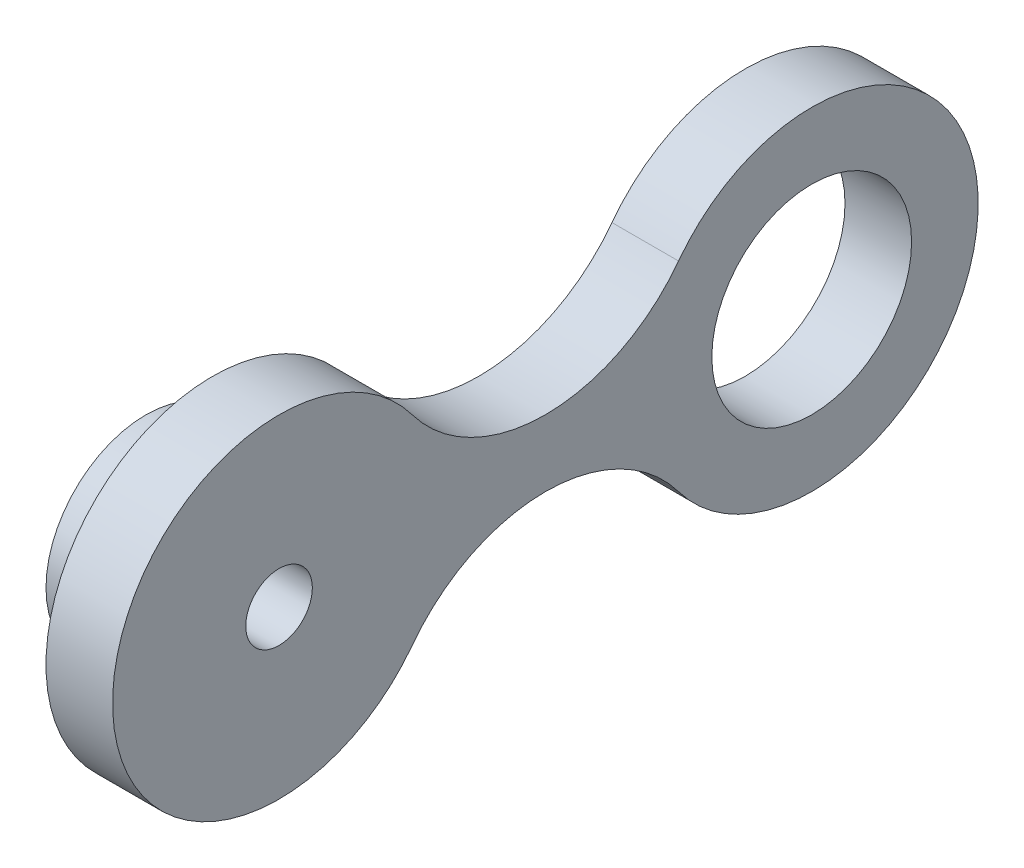
ISO-10303-21;
HEADER;
FILE_DESCRIPTION(('STEP AP214'),'2;1');
FILE_NAME('part.step','',(''),(''),'','','');
FILE_SCHEMA(('AUTOMOTIVE_DESIGN { 1 0 10303 214 1 1 1 1 }'));
ENDSEC;
DATA;
#1=APPLICATION_CONTEXT('core data for automotive mechanical design processes');
#2=APPLICATION_PROTOCOL_DEFINITION('international standard','automotive_design',2000,#1);
#3=PRODUCT_CONTEXT('',#1,'mechanical');
#4=PRODUCT('Part','Part','',(#3));
#5=PRODUCT_RELATED_PRODUCT_CATEGORY('part','',(#4));
#6=PRODUCT_DEFINITION_FORMATION('','',#4);
#7=PRODUCT_DEFINITION_CONTEXT('part definition',#1,'design');
#8=PRODUCT_DEFINITION('design','',#6,#7);
#9=PRODUCT_DEFINITION_SHAPE('','',#8);
#10=(LENGTH_UNIT() NAMED_UNIT(*) SI_UNIT(.MILLI.,.METRE.));
#11=(NAMED_UNIT(*) PLANE_ANGLE_UNIT() SI_UNIT($,.RADIAN.));
#12=(NAMED_UNIT(*) SI_UNIT($,.STERADIAN.) SOLID_ANGLE_UNIT());
#13=UNCERTAINTY_MEASURE_WITH_UNIT(LENGTH_MEASURE(1.E-05),#10,'distance_accuracy_value','');
#14=(GEOMETRIC_REPRESENTATION_CONTEXT(3) GLOBAL_UNCERTAINTY_ASSIGNED_CONTEXT((#13)) GLOBAL_UNIT_ASSIGNED_CONTEXT((#10,
#11,#12)) REPRESENTATION_CONTEXT('',''));
#15=CARTESIAN_POINT('',(0.,0.,0.));
#16=DIRECTION('',(0.,0.,1.));
#17=DIRECTION('',(1.,0.,0.));
#18=AXIS2_PLACEMENT_3D('',#15,#16,#17);
#19=CARTESIAN_POINT('',(10.,-30.,-40.));
#20=DIRECTION('',(-1.,0.,0.));
#21=DIRECTION('',(0.,0.,1.));
#22=AXIS2_PLACEMENT_3D('',#19,#20,#21);
#23=CYLINDRICAL_SURFACE('',#22,25.);
#24=CARTESIAN_POINT('',(0.,-30.,-40.));
#25=DIRECTION('',(1.,0.,0.));
#26=DIRECTION('',(0.,0.,-1.));
#27=AXIS2_PLACEMENT_3D('',#24,#25,#26);
#28=CIRCLE('',#27,25.);
#29=CARTESIAN_POINT('',(0.,-15.,-20.));
#30=VERTEX_POINT('',#29);
#31=CARTESIAN_POINT('',(0.,-15.,-60.));
#32=VERTEX_POINT('',#31);
#33=EDGE_CURVE('E109',#30,#32,#28,.F.);
#34=ORIENTED_EDGE('',*,*,#33,.T.);
#35=DIRECTION('',(-1.,0.,0.));
#36=VECTOR('',#35,1.);
#37=CARTESIAN_POINT('',(10.,-15.,-60.));
#38=LINE('',#37,#36);
#39=CARTESIAN_POINT('',(10.,-15.,-60.));
#40=VERTEX_POINT('',#39);
#41=EDGE_CURVE('E48',#40,#32,#38,.T.);
#42=ORIENTED_EDGE('',*,*,#41,.F.);
#43=CARTESIAN_POINT('',(10.,-30.,-40.));
#44=DIRECTION('',(1.,0.,0.));
#45=DIRECTION('',(0.,0.,-1.));
#46=AXIS2_PLACEMENT_3D('',#43,#44,#45);
#47=CIRCLE('',#46,25.);
#48=CARTESIAN_POINT('',(10.,-15.,-20.));
#49=VERTEX_POINT('',#48);
#50=EDGE_CURVE('E89',#49,#40,#47,.F.);
#51=ORIENTED_EDGE('',*,*,#50,.F.);
#52=DIRECTION('',(-1.,0.,0.));
#53=VECTOR('',#52,1.);
#54=CARTESIAN_POINT('',(10.,-15.,-20.));
#55=LINE('',#54,#53);
#56=EDGE_CURVE('E108',#49,#30,#55,.T.);
#57=ORIENTED_EDGE('',*,*,#56,.T.);
#58=EDGE_LOOP('',(#34,#42,#51,#57));
#59=FACE_BOUND('',#58,.T.);
#60=ADVANCED_FACE('F40',(#59),#23,.F.);
#61=CARTESIAN_POINT('',(10.,0.,-80.));
#62=DIRECTION('',(-1.,0.,0.));
#63=DIRECTION('',(0.,0.,1.));
#64=AXIS2_PLACEMENT_3D('',#61,#62,#63);
#65=CYLINDRICAL_SURFACE('',#64,25.);
#66=CARTESIAN_POINT('',(0.,0.,-80.));
#67=DIRECTION('',(1.,0.,0.));
#68=DIRECTION('',(0.,0.,-1.));
#69=AXIS2_PLACEMENT_3D('',#66,#67,#68);
#70=CIRCLE('',#69,25.);
#71=CARTESIAN_POINT('',(0.,15.,-60.));
#72=VERTEX_POINT('',#71);
#73=EDGE_CURVE('E95',#32,#72,#70,.T.);
#74=ORIENTED_EDGE('',*,*,#73,.T.);
#75=DIRECTION('',(-1.,0.,0.));
#76=VECTOR('',#75,1.);
#77=CARTESIAN_POINT('',(10.,15.,-60.));
#78=LINE('',#77,#76);
#79=CARTESIAN_POINT('',(10.,15.,-60.));
#80=VERTEX_POINT('',#79);
#81=EDGE_CURVE('E93',#80,#72,#78,.T.);
#82=ORIENTED_EDGE('',*,*,#81,.F.);
#83=CARTESIAN_POINT('',(10.,0.,-80.));
#84=DIRECTION('',(1.,0.,0.));
#85=DIRECTION('',(0.,0.,-1.));
#86=AXIS2_PLACEMENT_3D('',#83,#84,#85);
#87=CIRCLE('',#86,25.);
#88=EDGE_CURVE('E83',#40,#80,#87,.T.);
#89=ORIENTED_EDGE('',*,*,#88,.F.);
#90=ORIENTED_EDGE('',*,*,#41,.T.);
#91=EDGE_LOOP('',(#74,#82,#89,#90));
#92=FACE_BOUND('',#91,.T.);
#93=ADVANCED_FACE('F94',(#92),#65,.T.);
#94=CARTESIAN_POINT('',(10.,30.,-40.));
#95=DIRECTION('',(-1.,0.,0.));
#96=DIRECTION('',(0.,0.,1.));
#97=AXIS2_PLACEMENT_3D('',#94,#95,#96);
#98=CYLINDRICAL_SURFACE('',#97,25.);
#99=CARTESIAN_POINT('',(0.,30.,-40.));
#100=DIRECTION('',(1.,0.,0.));
#101=DIRECTION('',(0.,0.,-1.));
#102=AXIS2_PLACEMENT_3D('',#99,#100,#101);
#103=CIRCLE('',#102,25.);
#104=CARTESIAN_POINT('',(0.,15.,-20.));
#105=VERTEX_POINT('',#104);
#106=EDGE_CURVE('E114',#105,#72,#103,.T.);
#107=ORIENTED_EDGE('',*,*,#106,.F.);
#108=DIRECTION('',(-1.,0.,0.));
#109=VECTOR('',#108,1.);
#110=CARTESIAN_POINT('',(10.,15.,-20.));
#111=LINE('',#110,#109);
#112=CARTESIAN_POINT('',(10.,15.,-20.));
#113=VERTEX_POINT('',#112);
#114=EDGE_CURVE('E72',#113,#105,#111,.T.);
#115=ORIENTED_EDGE('',*,*,#114,.F.);
#116=CARTESIAN_POINT('',(10.,30.,-40.));
#117=DIRECTION('',(1.,0.,0.));
#118=DIRECTION('',(0.,0.,-1.));
#119=AXIS2_PLACEMENT_3D('',#116,#117,#118);
#120=CIRCLE('',#119,25.);
#121=EDGE_CURVE('E87',#113,#80,#120,.T.);
#122=ORIENTED_EDGE('',*,*,#121,.T.);
#123=ORIENTED_EDGE('',*,*,#81,.T.);
#124=EDGE_LOOP('',(#107,#115,#122,#123));
#125=FACE_BOUND('',#124,.T.);
#126=ADVANCED_FACE('F100',(#125),#98,.F.);
#127=CARTESIAN_POINT('',(10.,0.,0.));
#128=DIRECTION('',(-1.,0.,0.));
#129=DIRECTION('',(0.,0.,1.));
#130=AXIS2_PLACEMENT_3D('',#127,#128,#129);
#131=CYLINDRICAL_SURFACE('',#130,25.);
#132=CARTESIAN_POINT('',(0.,0.,0.));
#133=DIRECTION('',(1.,0.,0.));
#134=DIRECTION('',(0.,0.,-1.));
#135=AXIS2_PLACEMENT_3D('',#132,#133,#134);
#136=CIRCLE('',#135,25.);
#137=EDGE_CURVE('E75',#105,#30,#136,.T.);
#138=ORIENTED_EDGE('',*,*,#137,.T.);
#139=ORIENTED_EDGE('',*,*,#56,.F.);
#140=CARTESIAN_POINT('',(10.,0.,0.));
#141=DIRECTION('',(1.,0.,0.));
#142=DIRECTION('',(0.,0.,-1.));
#143=AXIS2_PLACEMENT_3D('',#140,#141,#142);
#144=CIRCLE('',#143,25.);
#145=EDGE_CURVE('E56',#113,#49,#144,.T.);
#146=ORIENTED_EDGE('',*,*,#145,.F.);
#147=ORIENTED_EDGE('',*,*,#114,.T.);
#148=EDGE_LOOP('',(#138,#139,#146,#147));
#149=FACE_BOUND('',#148,.T.);
#150=ADVANCED_FACE('F134',(#149),#131,.T.);
#151=CARTESIAN_POINT('',(10.,0.,-80.));
#152=DIRECTION('',(-1.,0.,0.));
#153=DIRECTION('',(0.,0.,1.));
#154=AXIS2_PLACEMENT_3D('',#151,#152,#153);
#155=CYLINDRICAL_SURFACE('',#154,15.);
#156=CARTESIAN_POINT('',(10.,0.,-80.));
#157=DIRECTION('',(1.,0.,0.));
#158=DIRECTION('',(0.,0.,-1.));
#159=AXIS2_PLACEMENT_3D('',#156,#157,#158);
#160=CIRCLE('',#159,15.);
#161=CARTESIAN_POINT('',(10.,0.,-95.));
#162=VERTEX_POINT('',#161);
#163=EDGE_CURVE('E102',#162,#162,#160,.T.);
#164=ORIENTED_EDGE('',*,*,#163,.T.);
#165=EDGE_LOOP('',(#164));
#166=FACE_BOUND('',#165,.T.);
#167=CARTESIAN_POINT('',(0.,0.,-80.));
#168=DIRECTION('',(1.,0.,0.));
#169=DIRECTION('',(0.,0.,-1.));
#170=AXIS2_PLACEMENT_3D('',#167,#168,#169);
#171=CIRCLE('',#170,15.);
#172=CARTESIAN_POINT('',(0.,0.,-95.));
#173=VERTEX_POINT('',#172);
#174=EDGE_CURVE('E117',#173,#173,#171,.T.);
#175=ORIENTED_EDGE('',*,*,#174,.F.);
#176=EDGE_LOOP('',(#175));
#177=FACE_BOUND('',#176,.T.);
#178=ADVANCED_FACE('F132',(#166,#177),#155,.F.);
#179=CARTESIAN_POINT('',(10.,0.,0.));
#180=DIRECTION('',(1.,0.,0.));
#181=DIRECTION('',(0.,0.,-1.));
#182=AXIS2_PLACEMENT_3D('',#179,#180,#181);
#183=PLANE('',#182);
#184=CARTESIAN_POINT('',(10.,0.,0.));
#185=DIRECTION('',(1.,0.,0.));
#186=DIRECTION('',(0.,0.,-1.));
#187=AXIS2_PLACEMENT_3D('',#184,#185,#186);
#188=CIRCLE('',#187,5.);
#189=CARTESIAN_POINT('',(10.,0.,-5.));
#190=VERTEX_POINT('',#189);
#191=EDGE_CURVE('E213',#190,#190,#188,.T.);
#192=ORIENTED_EDGE('',*,*,#191,.F.);
#193=EDGE_LOOP('',(#192));
#194=FACE_BOUND('',#193,.T.);
#195=ORIENTED_EDGE('',*,*,#50,.T.);
#196=ORIENTED_EDGE('',*,*,#88,.T.);
#197=ORIENTED_EDGE('',*,*,#121,.F.);
#198=ORIENTED_EDGE('',*,*,#145,.T.);
#199=EDGE_LOOP('',(#195,#196,#197,#198));
#200=FACE_BOUND('',#199,.T.);
#201=ORIENTED_EDGE('',*,*,#163,.F.);
#202=EDGE_LOOP('',(#201));
#203=FACE_BOUND('',#202,.T.);
#204=ADVANCED_FACE('F84',(#194,#200,#203),#183,.T.);
#205=CARTESIAN_POINT('',(0.,0.,0.));
#206=DIRECTION('',(1.,0.,0.));
#207=DIRECTION('',(0.,0.,-1.));
#208=AXIS2_PLACEMENT_3D('',#205,#206,#207);
#209=PLANE('',#208);
#210=CARTESIAN_POINT('',(0.,0.,0.));
#211=DIRECTION('',(1.,0.,0.));
#212=DIRECTION('',(0.,0.,-1.));
#213=AXIS2_PLACEMENT_3D('',#210,#211,#212);
#214=CIRCLE('',#213,15.);
#215=CARTESIAN_POINT('',(0.,0.,-15.));
#216=VERTEX_POINT('',#215);
#217=EDGE_CURVE('E11',#216,#216,#214,.F.);
#218=ORIENTED_EDGE('',*,*,#217,.F.);
#219=EDGE_LOOP('',(#218));
#220=FACE_BOUND('',#219,.T.);
#221=ORIENTED_EDGE('',*,*,#33,.F.);
#222=ORIENTED_EDGE('',*,*,#137,.F.);
#223=ORIENTED_EDGE('',*,*,#106,.T.);
#224=ORIENTED_EDGE('',*,*,#73,.F.);
#225=EDGE_LOOP('',(#221,#222,#223,#224));
#226=FACE_BOUND('',#225,.T.);
#227=ORIENTED_EDGE('',*,*,#174,.T.);
#228=EDGE_LOOP('',(#227));
#229=FACE_BOUND('',#228,.T.);
#230=ADVANCED_FACE('F124',(#220,#226,#229),#209,.F.);
#231=CARTESIAN_POINT('',(-10.,0.,0.));
#232=DIRECTION('',(1.,0.,0.));
#233=DIRECTION('',(0.,0.,-1.));
#234=AXIS2_PLACEMENT_3D('',#231,#232,#233);
#235=CYLINDRICAL_SURFACE('',#234,15.);
#236=CARTESIAN_POINT('',(-10.,0.,0.));
#237=DIRECTION('',(-1.,0.,0.));
#238=DIRECTION('',(0.,0.,1.));
#239=AXIS2_PLACEMENT_3D('',#236,#237,#238);
#240=CIRCLE('',#239,15.);
#241=CARTESIAN_POINT('',(-10.,0.,15.));
#242=VERTEX_POINT('',#241);
#243=EDGE_CURVE('E112',#242,#242,#240,.T.);
#244=ORIENTED_EDGE('',*,*,#243,.F.);
#245=EDGE_LOOP('',(#244));
#246=FACE_BOUND('',#245,.T.);
#247=ORIENTED_EDGE('',*,*,#217,.T.);
#248=EDGE_LOOP('',(#247));
#249=FACE_BOUND('',#248,.T.);
#250=ADVANCED_FACE('F127',(#246,#249),#235,.T.);
#251=CARTESIAN_POINT('',(-10.,0.,0.));
#252=DIRECTION('',(-1.,0.,0.));
#253=DIRECTION('',(0.,0.,1.));
#254=AXIS2_PLACEMENT_3D('',#251,#252,#253);
#255=PLANE('',#254);
#256=CARTESIAN_POINT('',(-10.,0.,0.));
#257=DIRECTION('',(-1.,0.,0.));
#258=DIRECTION('',(0.,0.,1.));
#259=AXIS2_PLACEMENT_3D('',#256,#257,#258);
#260=CIRCLE('',#259,5.);
#261=CARTESIAN_POINT('',(-10.,0.,5.));
#262=VERTEX_POINT('',#261);
#263=EDGE_CURVE('E216',#262,#262,#260,.T.);
#264=ORIENTED_EDGE('',*,*,#263,.F.);
#265=EDGE_LOOP('',(#264));
#266=FACE_BOUND('',#265,.T.);
#267=ORIENTED_EDGE('',*,*,#243,.T.);
#268=EDGE_LOOP('',(#267));
#269=FACE_BOUND('',#268,.T.);
#270=ADVANCED_FACE('F180',(#266,#269),#255,.T.);
#271=CARTESIAN_POINT('',(26.,0.,0.));
#272=DIRECTION('',(-1.,0.,0.));
#273=DIRECTION('',(0.,0.,1.));
#274=AXIS2_PLACEMENT_3D('',#271,#272,#273);
#275=CYLINDRICAL_SURFACE('',#274,5.);
#276=ORIENTED_EDGE('',*,*,#191,.T.);
#277=EDGE_LOOP('',(#276));
#278=FACE_BOUND('',#277,.T.);
#279=ORIENTED_EDGE('',*,*,#263,.T.);
#280=EDGE_LOOP('',(#279));
#281=FACE_BOUND('',#280,.T.);
#282=ADVANCED_FACE('F196',(#278,#281),#275,.F.);
#283=CLOSED_SHELL('',(#60,#93,#126,#150,#178,#204,#230,#250,#270,#282));
#284=MANIFOLD_SOLID_BREP('B2',#283);
#285=ADVANCED_BREP_SHAPE_REPRESENTATION('',(#18,#284),#14);
#286=SHAPE_DEFINITION_REPRESENTATION(#9,#285);
ENDSEC;
END-ISO-10303-21;
